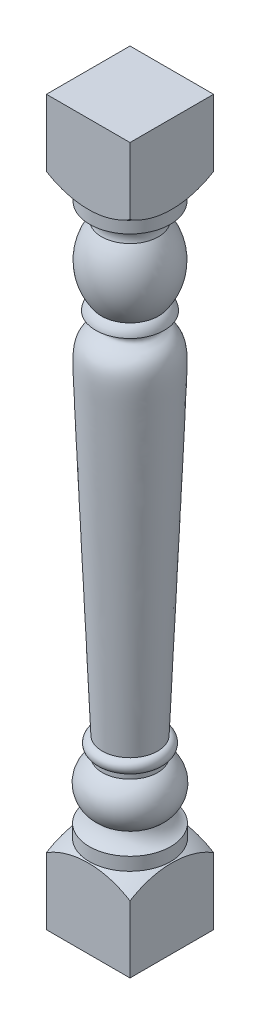
ISO-10303-21;
HEADER;
FILE_DESCRIPTION(('STEP AP214'),'2;1');
FILE_NAME('part.step','',(''),(''),'','','');
FILE_SCHEMA(('AUTOMOTIVE_DESIGN { 1 0 10303 214 1 1 1 1 }'));
ENDSEC;
DATA;
#1=APPLICATION_CONTEXT('core data for automotive mechanical design processes');
#2=APPLICATION_PROTOCOL_DEFINITION('international standard','automotive_design',2000,#1);
#3=PRODUCT_CONTEXT('',#1,'mechanical');
#4=PRODUCT('Part','Part','',(#3));
#5=PRODUCT_RELATED_PRODUCT_CATEGORY('part','',(#4));
#6=PRODUCT_DEFINITION_FORMATION('','',#4);
#7=PRODUCT_DEFINITION_CONTEXT('part definition',#1,'design');
#8=PRODUCT_DEFINITION('design','',#6,#7);
#9=PRODUCT_DEFINITION_SHAPE('','',#8);
#10=(LENGTH_UNIT() NAMED_UNIT(*) SI_UNIT(.MILLI.,.METRE.));
#11=(NAMED_UNIT(*) PLANE_ANGLE_UNIT() SI_UNIT($,.RADIAN.));
#12=(NAMED_UNIT(*) SI_UNIT($,.STERADIAN.) SOLID_ANGLE_UNIT());
#13=UNCERTAINTY_MEASURE_WITH_UNIT(LENGTH_MEASURE(1.E-05),#10,'distance_accuracy_value','');
#14=(GEOMETRIC_REPRESENTATION_CONTEXT(3) GLOBAL_UNCERTAINTY_ASSIGNED_CONTEXT((#13)) GLOBAL_UNIT_ASSIGNED_CONTEXT((#10,
#11,#12)) REPRESENTATION_CONTEXT('',''));
#15=CARTESIAN_POINT('',(0.,0.,0.));
#16=DIRECTION('',(0.,0.,1.));
#17=DIRECTION('',(1.,0.,0.));
#18=AXIS2_PLACEMENT_3D('',#15,#16,#17);
#19=CARTESIAN_POINT('',(71.4375,1101.13709756262,0.));
#20=DIRECTION('',(0.,-1.,0.));
#21=DIRECTION('',(-1.,0.,0.));
#22=AXIS2_PLACEMENT_3D('',#19,#20,#21);
#23=SPHERICAL_SURFACE('',#22,152.4);
#24=CARTESIAN_POINT('',(71.4375,965.2,0.));
#25=DIRECTION('',(0.,-1.,0.));
#26=DIRECTION('',(0.,0.,-1.));
#27=AXIS2_PLACEMENT_3D('',#24,#25,#26);
#28=CIRCLE('',#27,68.8975);
#29=CARTESIAN_POINT('',(71.4375,965.2,-68.8975));
#30=VERTEX_POINT('',#29);
#31=EDGE_CURVE('E224',#30,#30,#28,.T.);
#32=ORIENTED_EDGE('',*,*,#31,.F.);
#33=EDGE_LOOP('',(#32));
#34=FACE_BOUND('',#33,.T.);
#35=CARTESIAN_POINT('',(0.,1101.13709756262,0.));
#36=DIRECTION('',(-1.,0.,0.));
#37=DIRECTION('',(0.,0.,1.));
#38=AXIS2_PLACEMENT_3D('',#35,#36,#37);
#39=CIRCLE('',#38,134.619625589102);
#40=CARTESIAN_POINT('',(0.,987.035707617101,-71.4375));
#41=VERTEX_POINT('',#40);
#42=CARTESIAN_POINT('',(0.,987.035707617101,71.4375));
#43=VERTEX_POINT('',#42);
#44=EDGE_CURVE('E107',#41,#43,#39,.T.);
#45=ORIENTED_EDGE('',*,*,#44,.F.);
#46=CARTESIAN_POINT('',(71.4375,1101.13709756262,-71.4375));
#47=DIRECTION('',(0.,0.,-1.));
#48=DIRECTION('',(-1.,0.,0.));
#49=AXIS2_PLACEMENT_3D('',#46,#47,#48);
#50=CIRCLE('',#49,134.619625589102);
#51=CARTESIAN_POINT('',(142.875,987.035707617101,-71.4375));
#52=VERTEX_POINT('',#51);
#53=EDGE_CURVE('E149',#52,#41,#50,.T.);
#54=ORIENTED_EDGE('',*,*,#53,.F.);
#55=CARTESIAN_POINT('',(142.875,1101.13709756262,0.));
#56=DIRECTION('',(1.,0.,0.));
#57=DIRECTION('',(0.,0.,-1.));
#58=AXIS2_PLACEMENT_3D('',#55,#56,#57);
#59=CIRCLE('',#58,134.619625589102);
#60=CARTESIAN_POINT('',(142.875,987.035707617101,71.4374999999999));
#61=VERTEX_POINT('',#60);
#62=EDGE_CURVE('E147',#61,#52,#59,.T.);
#63=ORIENTED_EDGE('',*,*,#62,.F.);
#64=CARTESIAN_POINT('',(71.4375000000001,1101.13709756262,71.4374999999999));
#65=DIRECTION('',(0.,0.,1.));
#66=DIRECTION('',(1.,0.,0.));
#67=AXIS2_PLACEMENT_3D('',#64,#65,#66);
#68=CIRCLE('',#67,134.619625589102);
#69=EDGE_CURVE('E138',#43,#61,#68,.T.);
#70=ORIENTED_EDGE('',*,*,#69,.F.);
#71=EDGE_LOOP('',(#45,#54,#63,#70));
#72=FACE_BOUND('',#71,.T.);
#73=ADVANCED_FACE('F33',(#34,#72),#23,.T.);
#74=CARTESIAN_POINT('',(71.4375,-135.613389618245,0.));
#75=DIRECTION('',(0.,-1.,0.));
#76=DIRECTION('',(-1.,0.,0.));
#77=AXIS2_PLACEMENT_3D('',#74,#75,#76);
#78=SPHERICAL_SURFACE('',#77,152.4);
#79=CARTESIAN_POINT('',(71.4375,0.,0.));
#80=DIRECTION('',(0.,-1.,0.));
#81=DIRECTION('',(0.,0.,-1.));
#82=AXIS2_PLACEMENT_3D('',#79,#80,#81);
#83=CIRCLE('',#82,69.5325);
#84=CARTESIAN_POINT('',(71.4375,0.,-69.5325));
#85=VERTEX_POINT('',#84);
#86=EDGE_CURVE('E152',#85,#85,#83,.T.);
#87=ORIENTED_EDGE('',*,*,#86,.T.);
#88=EDGE_LOOP('',(#87));
#89=FACE_BOUND('',#88,.T.);
#90=CARTESIAN_POINT('',(0.,-135.613389618245,0.));
#91=DIRECTION('',(-1.,0.,0.));
#92=DIRECTION('',(0.,0.,1.));
#93=AXIS2_PLACEMENT_3D('',#90,#91,#92);
#94=CIRCLE('',#93,134.619625589102);
#95=CARTESIAN_POINT('',(0.,-21.5119996727236,71.4375));
#96=VERTEX_POINT('',#95);
#97=CARTESIAN_POINT('',(0.,-21.5119996727236,-71.4375));
#98=VERTEX_POINT('',#97);
#99=EDGE_CURVE('E12',#96,#98,#94,.T.);
#100=ORIENTED_EDGE('',*,*,#99,.F.);
#101=CARTESIAN_POINT('',(71.4375000000001,-135.613389618245,71.4374999999999));
#102=DIRECTION('',(0.,0.,1.));
#103=DIRECTION('',(1.,0.,0.));
#104=AXIS2_PLACEMENT_3D('',#101,#102,#103);
#105=CIRCLE('',#104,134.619625589102);
#106=CARTESIAN_POINT('',(142.875,-21.5119996727235,71.4374999999999));
#107=VERTEX_POINT('',#106);
#108=EDGE_CURVE('E217',#107,#96,#105,.T.);
#109=ORIENTED_EDGE('',*,*,#108,.F.);
#110=CARTESIAN_POINT('',(142.875,-135.613389618245,0.));
#111=DIRECTION('',(1.,0.,0.));
#112=DIRECTION('',(0.,0.,-1.));
#113=AXIS2_PLACEMENT_3D('',#110,#111,#112);
#114=CIRCLE('',#113,134.619625589102);
#115=CARTESIAN_POINT('',(142.875,-21.5119996727235,-71.4375));
#116=VERTEX_POINT('',#115);
#117=EDGE_CURVE('E223',#116,#107,#114,.T.);
#118=ORIENTED_EDGE('',*,*,#117,.F.);
#119=CARTESIAN_POINT('',(71.4375,-135.613389618245,-71.4375));
#120=DIRECTION('',(0.,0.,-1.));
#121=DIRECTION('',(-1.,0.,0.));
#122=AXIS2_PLACEMENT_3D('',#119,#120,#121);
#123=CIRCLE('',#122,134.619625589102);
#124=EDGE_CURVE('E41',#98,#116,#123,.T.);
#125=ORIENTED_EDGE('',*,*,#124,.F.);
#126=EDGE_LOOP('',(#100,#109,#118,#125));
#127=FACE_BOUND('',#126,.T.);
#128=ADVANCED_FACE('F184',(#89,#127),#78,.T.);
#129=CARTESIAN_POINT('',(71.4375,-135.613389618245,0.));
#130=DIRECTION('',(0.,-1.,0.));
#131=DIRECTION('',(0.,0.,-1.));
#132=AXIS2_PLACEMENT_3D('',#129,#130,#131);
#133=CYLINDRICAL_SURFACE('',#132,68.8975);
#134=CARTESIAN_POINT('',(71.4375,942.975,0.));
#135=DIRECTION('',(0.,-1.,0.));
#136=DIRECTION('',(0.,0.,-1.));
#137=AXIS2_PLACEMENT_3D('',#134,#135,#136);
#138=CIRCLE('',#137,68.8975);
#139=CARTESIAN_POINT('',(71.4375,942.975,-68.8975));
#140=VERTEX_POINT('',#139);
#141=EDGE_CURVE('E233',#140,#140,#138,.T.);
#142=ORIENTED_EDGE('',*,*,#141,.F.);
#143=EDGE_LOOP('',(#142));
#144=FACE_BOUND('',#143,.T.);
#145=ORIENTED_EDGE('',*,*,#31,.T.);
#146=EDGE_LOOP('',(#145));
#147=FACE_BOUND('',#146,.T.);
#148=ADVANCED_FACE('F180',(#144,#147),#133,.T.);
#149=CARTESIAN_POINT('',(71.4375,921.049803557332,0.));
#150=DIRECTION('',(0.,-1.,0.));
#151=DIRECTION('',(0.,0.,-1.));
#152=AXIS2_PLACEMENT_3D('',#149,#150,#151);
#153=TOROIDAL_SURFACE('',#152,69.4780106225019,21.9328801490461);
#154=CARTESIAN_POINT('',(71.4375,914.4,0.));
#155=DIRECTION('',(0.,-1.,0.));
#156=DIRECTION('',(0.,0.,-1.));
#157=AXIS2_PLACEMENT_3D('',#154,#155,#156);
#158=CIRCLE('',#157,48.5775);
#159=CARTESIAN_POINT('',(71.4375,914.4,-48.5775));
#160=VERTEX_POINT('',#159);
#161=EDGE_CURVE('E236',#160,#160,#158,.T.);
#162=ORIENTED_EDGE('',*,*,#161,.F.);
#163=EDGE_LOOP('',(#162));
#164=FACE_BOUND('',#163,.T.);
#165=ORIENTED_EDGE('',*,*,#141,.T.);
#166=EDGE_LOOP('',(#165));
#167=FACE_BOUND('',#166,.T.);
#168=ADVANCED_FACE('F176',(#164,#167),#153,.F.);
#169=CARTESIAN_POINT('',(71.4375,855.6625,0.));
#170=DIRECTION('',(0.,-1.,0.));
#171=DIRECTION('',(0.,0.,-1.));
#172=AXIS2_PLACEMENT_3D('',#169,#170,#171);
#173=DEGENERATE_TOROIDAL_SURFACE('',#172,26.15654296875,95.05404296875,.F.);
#174=CARTESIAN_POINT('',(71.4375,796.925,0.));
#175=DIRECTION('',(0.,-1.,0.));
#176=DIRECTION('',(0.,0.,-1.));
#177=AXIS2_PLACEMENT_3D('',#174,#175,#176);
#178=CIRCLE('',#177,48.5775);
#179=CARTESIAN_POINT('',(71.4375,796.925,-48.5775));
#180=VERTEX_POINT('',#179);
#181=EDGE_CURVE('E239',#180,#180,#178,.T.);
#182=ORIENTED_EDGE('',*,*,#181,.F.);
#183=EDGE_LOOP('',(#182));
#184=FACE_BOUND('',#183,.T.);
#185=ORIENTED_EDGE('',*,*,#161,.T.);
#186=EDGE_LOOP('',(#185));
#187=FACE_BOUND('',#186,.T.);
#188=ADVANCED_FACE('F172',(#184,#187),#173,.F.);
#189=CARTESIAN_POINT('',(71.4375,777.398971107614,0.));
#190=DIRECTION('',(0.,-1.,0.));
#191=DIRECTION('',(0.,0.,-1.));
#192=AXIS2_PLACEMENT_3D('',#189,#190,#191);
#193=TOROIDAL_SURFACE('',#192,35.5504236056465,23.4727613137148);
#194=CARTESIAN_POINT('',(71.4375,781.05,0.));
#195=DIRECTION('',(0.,-1.,0.));
#196=DIRECTION('',(0.,0.,-1.));
#197=AXIS2_PLACEMENT_3D('',#194,#195,#196);
#198=CIRCLE('',#197,58.7375);
#199=CARTESIAN_POINT('',(71.4375,781.05,-58.7375));
#200=VERTEX_POINT('',#199);
#201=EDGE_CURVE('E242',#200,#200,#198,.T.);
#202=ORIENTED_EDGE('',*,*,#201,.F.);
#203=EDGE_LOOP('',(#202));
#204=FACE_BOUND('',#203,.T.);
#205=ORIENTED_EDGE('',*,*,#181,.T.);
#206=EDGE_LOOP('',(#205));
#207=FACE_BOUND('',#206,.T.);
#208=ADVANCED_FACE('F167',(#204,#207),#193,.T.);
#209=CARTESIAN_POINT('',(12.7,781.05,0.));
#210=CARTESIAN_POINT('',(28.5432760874866,778.212494124959,0.));
#211=CARTESIAN_POINT('',(43.2562729493515,750.690215212591,0.));
#212=CARTESIAN_POINT('',(-0.0352258001827218,758.012837993779,0.));
#213=CARTESIAN_POINT('',(6.58631930102401,584.753689168039,0.));
#214=CARTESIAN_POINT('',(4.68311177432794,626.517341683283,0.));
#215=CARTESIAN_POINT('',(24.13,152.399999999999,0.));
#216=B_SPLINE_CURVE_WITH_KNOTS('',3,(#209,#210,#211,#212,#213,#214,#215),.UNSPECIFIED.,.F.,.F.,
(4,1,1,1,4),(0.,0.117084259686259,0.342939455018495,0.431231029049869,1.),.UNSPECIFIED.);
#217=CARTESIAN_POINT('',(71.4375,-135.613389618245,0.));
#218=DIRECTION('',(0.,-1.,0.));
#219=AXIS1_PLACEMENT('',#217,#218);
#220=SURFACE_OF_REVOLUTION('',#216,#219);
#221=CARTESIAN_POINT('',(71.4375,152.399999999999,0.));
#222=DIRECTION('',(0.,-1.,0.));
#223=DIRECTION('',(0.,0.,-1.));
#224=AXIS2_PLACEMENT_3D('',#221,#222,#223);
#225=CIRCLE('',#224,47.3075);
#226=CARTESIAN_POINT('',(71.4375,152.399999999999,-47.3075));
#227=VERTEX_POINT('',#226);
#228=EDGE_CURVE('E245',#227,#227,#225,.T.);
#229=ORIENTED_EDGE('',*,*,#228,.F.);
#230=EDGE_LOOP('',(#229));
#231=FACE_BOUND('',#230,.T.);
#232=ORIENTED_EDGE('',*,*,#201,.T.);
#233=EDGE_LOOP('',(#232));
#234=FACE_BOUND('',#233,.T.);
#235=ADVANCED_FACE('F162',(#231,#234),#220,.T.);
#236=CARTESIAN_POINT('',(71.4375,141.2875,0.));
#237=DIRECTION('',(0.,-1.,0.));
#238=DIRECTION('',(0.,0.,-1.));
#239=AXIS2_PLACEMENT_3D('',#236,#237,#238);
#240=TOROIDAL_SURFACE('',#239,46.3103515625,11.1571484375);
#241=CARTESIAN_POINT('',(71.4375,130.175,0.));
#242=DIRECTION('',(0.,-1.,0.));
#243=DIRECTION('',(0.,0.,-1.));
#244=AXIS2_PLACEMENT_3D('',#241,#242,#243);
#245=CIRCLE('',#244,47.3075);
#246=CARTESIAN_POINT('',(71.4375,130.175,-47.3075));
#247=VERTEX_POINT('',#246);
#248=EDGE_CURVE('E248',#247,#247,#245,.T.);
#249=ORIENTED_EDGE('',*,*,#248,.F.);
#250=EDGE_LOOP('',(#249));
#251=FACE_BOUND('',#250,.T.);
#252=ORIENTED_EDGE('',*,*,#228,.T.);
#253=EDGE_LOOP('',(#252));
#254=FACE_BOUND('',#253,.T.);
#255=ADVANCED_FACE('F166',(#251,#254),#240,.T.);
#256=CARTESIAN_POINT('',(71.4375,-135.613389618245,0.));
#257=DIRECTION('',(0.,-1.,0.));
#258=DIRECTION('',(0.,0.,-1.));
#259=AXIS2_PLACEMENT_3D('',#256,#257,#258);
#260=CYLINDRICAL_SURFACE('',#259,47.3075);
#261=CARTESIAN_POINT('',(71.4375,120.65,0.));
#262=DIRECTION('',(0.,-1.,0.));
#263=DIRECTION('',(0.,0.,-1.));
#264=AXIS2_PLACEMENT_3D('',#261,#262,#263);
#265=CIRCLE('',#264,47.3075);
#266=CARTESIAN_POINT('',(71.4375,120.65,-47.3075));
#267=VERTEX_POINT('',#266);
#268=EDGE_CURVE('E251',#267,#267,#265,.T.);
#269=ORIENTED_EDGE('',*,*,#268,.F.);
#270=EDGE_LOOP('',(#269));
#271=FACE_BOUND('',#270,.T.);
#272=ORIENTED_EDGE('',*,*,#248,.T.);
#273=EDGE_LOOP('',(#272));
#274=FACE_BOUND('',#273,.T.);
#275=ADVANCED_FACE('F273',(#271,#274),#260,.T.);
#276=CARTESIAN_POINT('',(71.4375,82.1853057943023,0.));
#277=DIRECTION('',(0.,-1.,0.));
#278=DIRECTION('',(0.,0.,-1.));
#279=AXIS2_PLACEMENT_3D('',#276,#277,#278);
#280=DEGENERATE_TOROIDAL_SURFACE('',#279,26.0608476581362,43.942609572872,.T.);
#281=CARTESIAN_POINT('',(71.4375,44.45,0.));
#282=DIRECTION('',(0.,-1.,0.));
#283=DIRECTION('',(0.,0.,-1.));
#284=AXIS2_PLACEMENT_3D('',#281,#282,#283);
#285=CIRCLE('',#284,48.5775);
#286=CARTESIAN_POINT('',(71.4375,44.45,-48.5775));
#287=VERTEX_POINT('',#286);
#288=EDGE_CURVE('E254',#287,#287,#285,.T.);
#289=ORIENTED_EDGE('',*,*,#288,.F.);
#290=EDGE_LOOP('',(#289));
#291=FACE_BOUND('',#290,.T.);
#292=ORIENTED_EDGE('',*,*,#268,.T.);
#293=EDGE_LOOP('',(#292));
#294=FACE_BOUND('',#293,.T.);
#295=ADVANCED_FACE('F270',(#291,#294),#280,.T.);
#296=CARTESIAN_POINT('',(71.4375,56.6976099284752,0.));
#297=DIRECTION('',(0.,-1.,0.));
#298=DIRECTION('',(0.,0.,-1.));
#299=AXIS2_PLACEMENT_3D('',#296,#297,#298);
#300=TOROIDAL_SURFACE('',#299,83.8308741665646,37.3202939308882);
#301=CARTESIAN_POINT('',(71.4375,22.225,0.));
#302=DIRECTION('',(0.,-1.,0.));
#303=DIRECTION('',(0.,0.,-1.));
#304=AXIS2_PLACEMENT_3D('',#301,#302,#303);
#305=CIRCLE('',#304,69.5325);
#306=CARTESIAN_POINT('',(71.4375,22.225,-69.5325));
#307=VERTEX_POINT('',#306);
#308=EDGE_CURVE('E256',#307,#307,#305,.T.);
#309=ORIENTED_EDGE('',*,*,#308,.F.);
#310=EDGE_LOOP('',(#309));
#311=FACE_BOUND('',#310,.T.);
#312=ORIENTED_EDGE('',*,*,#288,.T.);
#313=EDGE_LOOP('',(#312));
#314=FACE_BOUND('',#313,.T.);
#315=ADVANCED_FACE('F213',(#311,#314),#300,.F.);
#316=CARTESIAN_POINT('',(71.4375,-135.613389618245,0.));
#317=DIRECTION('',(0.,-1.,0.));
#318=DIRECTION('',(0.,0.,-1.));
#319=AXIS2_PLACEMENT_3D('',#316,#317,#318);
#320=CYLINDRICAL_SURFACE('',#319,69.5325);
#321=ORIENTED_EDGE('',*,*,#86,.F.);
#322=EDGE_LOOP('',(#321));
#323=FACE_BOUND('',#322,.T.);
#324=ORIENTED_EDGE('',*,*,#308,.T.);
#325=EDGE_LOOP('',(#324));
#326=FACE_BOUND('',#325,.T.);
#327=ADVANCED_FACE('F205',(#323,#326),#320,.T.);
#328=CARTESIAN_POINT('',(0.,-135.613389618245,71.4375));
#329=DIRECTION('',(0.,0.,1.));
#330=DIRECTION('',(1.,0.,0.));
#331=AXIS2_PLACEMENT_3D('',#328,#329,#330);
#332=PLANE('',#331);
#333=ORIENTED_EDGE('',*,*,#108,.T.);
#334=DIRECTION('',(0.,1.,0.));
#335=VECTOR('',#334,1.);
#336=CARTESIAN_POINT('',(0.,-135.613389618245,71.4375));
#337=LINE('',#336,#335);
#338=CARTESIAN_POINT('',(0.,-135.613389618245,71.4375));
#339=VERTEX_POINT('',#338);
#340=EDGE_CURVE('E110',#339,#96,#337,.T.);
#341=ORIENTED_EDGE('',*,*,#340,.F.);
#342=DIRECTION('',(1.,0.,0.));
#343=VECTOR('',#342,1.);
#344=CARTESIAN_POINT('',(0.,-135.613389618245,71.4375));
#345=LINE('',#344,#343);
#346=CARTESIAN_POINT('',(142.875,-135.613389618245,71.4374999999999));
#347=VERTEX_POINT('',#346);
#348=EDGE_CURVE('E127',#339,#347,#345,.T.);
#349=ORIENTED_EDGE('',*,*,#348,.T.);
#350=DIRECTION('',(0.,1.,0.));
#351=VECTOR('',#350,1.);
#352=CARTESIAN_POINT('',(142.875,-135.613389618245,71.4374999999999));
#353=LINE('',#352,#351);
#354=EDGE_CURVE('E144',#347,#107,#353,.T.);
#355=ORIENTED_EDGE('',*,*,#354,.T.);
#356=EDGE_LOOP('',(#333,#341,#349,#355));
#357=FACE_BOUND('',#356,.T.);
#358=ADVANCED_FACE('F196',(#357),#332,.T.);
#359=CARTESIAN_POINT('',(142.875,-135.613389618245,-71.4375));
#360=DIRECTION('',(1.,0.,0.));
#361=DIRECTION('',(0.,0.,-1.));
#362=AXIS2_PLACEMENT_3D('',#359,#360,#361);
#363=PLANE('',#362);
#364=ORIENTED_EDGE('',*,*,#117,.T.);
#365=ORIENTED_EDGE('',*,*,#354,.F.);
#366=DIRECTION('',(0.,0.,-1.));
#367=VECTOR('',#366,1.);
#368=CARTESIAN_POINT('',(142.875,-135.613389618245,-71.4375));
#369=LINE('',#368,#367);
#370=CARTESIAN_POINT('',(142.875,-135.613389618245,-71.4375));
#371=VERTEX_POINT('',#370);
#372=EDGE_CURVE('E130',#347,#371,#369,.T.);
#373=ORIENTED_EDGE('',*,*,#372,.T.);
#374=DIRECTION('',(0.,1.,0.));
#375=VECTOR('',#374,1.);
#376=CARTESIAN_POINT('',(142.875,-135.613389618245,-71.4375));
#377=LINE('',#376,#375);
#378=EDGE_CURVE('E140',#371,#116,#377,.T.);
#379=ORIENTED_EDGE('',*,*,#378,.T.);
#380=EDGE_LOOP('',(#364,#365,#373,#379));
#381=FACE_BOUND('',#380,.T.);
#382=ADVANCED_FACE('F202',(#381),#363,.T.);
#383=CARTESIAN_POINT('',(0.,-135.613389618245,-71.4375));
#384=DIRECTION('',(0.,0.,-1.));
#385=DIRECTION('',(-1.,0.,0.));
#386=AXIS2_PLACEMENT_3D('',#383,#384,#385);
#387=PLANE('',#386);
#388=ORIENTED_EDGE('',*,*,#124,.T.);
#389=ORIENTED_EDGE('',*,*,#378,.F.);
#390=DIRECTION('',(-1.,0.,0.));
#391=VECTOR('',#390,1.);
#392=CARTESIAN_POINT('',(0.,-135.613389618245,-71.4375));
#393=LINE('',#392,#391);
#394=CARTESIAN_POINT('',(0.,-135.613389618245,-71.4375));
#395=VERTEX_POINT('',#394);
#396=EDGE_CURVE('E111',#371,#395,#393,.T.);
#397=ORIENTED_EDGE('',*,*,#396,.T.);
#398=DIRECTION('',(0.,1.,0.));
#399=VECTOR('',#398,1.);
#400=CARTESIAN_POINT('',(0.,-135.613389618245,-71.4375));
#401=LINE('',#400,#399);
#402=EDGE_CURVE('E135',#395,#98,#401,.T.);
#403=ORIENTED_EDGE('',*,*,#402,.T.);
#404=EDGE_LOOP('',(#388,#389,#397,#403));
#405=FACE_BOUND('',#404,.T.);
#406=ADVANCED_FACE('F211',(#405),#387,.T.);
#407=CARTESIAN_POINT('',(0.,-135.613389618245,-71.4375));
#408=DIRECTION('',(-1.,0.,0.));
#409=DIRECTION('',(0.,0.,1.));
#410=AXIS2_PLACEMENT_3D('',#407,#408,#409);
#411=PLANE('',#410);
#412=ORIENTED_EDGE('',*,*,#99,.T.);
#413=ORIENTED_EDGE('',*,*,#402,.F.);
#414=DIRECTION('',(0.,0.,1.));
#415=VECTOR('',#414,1.);
#416=CARTESIAN_POINT('',(0.,-135.613389618245,-71.4375));
#417=LINE('',#416,#415);
#418=EDGE_CURVE('E48',#395,#339,#417,.T.);
#419=ORIENTED_EDGE('',*,*,#418,.T.);
#420=ORIENTED_EDGE('',*,*,#340,.T.);
#421=EDGE_LOOP('',(#412,#413,#419,#420));
#422=FACE_BOUND('',#421,.T.);
#423=ADVANCED_FACE('F226',(#422),#411,.T.);
#424=ORIENTED_EDGE('',*,*,#44,.T.);
#425=CARTESIAN_POINT('',(0.,1101.13709756262,71.4375));
#426=VERTEX_POINT('',#425);
#427=EDGE_CURVE('E99',#43,#426,#337,.T.);
#428=ORIENTED_EDGE('',*,*,#427,.T.);
#429=DIRECTION('',(0.,0.,1.));
#430=VECTOR('',#429,1.);
#431=CARTESIAN_POINT('',(0.,1101.13709756262,-71.4375));
#432=LINE('',#431,#430);
#433=CARTESIAN_POINT('',(0.,1101.13709756262,-71.4375));
#434=VERTEX_POINT('',#433);
#435=EDGE_CURVE('E104',#434,#426,#432,.T.);
#436=ORIENTED_EDGE('',*,*,#435,.F.);
#437=EDGE_CURVE('E139',#41,#434,#401,.T.);
#438=ORIENTED_EDGE('',*,*,#437,.F.);
#439=EDGE_LOOP('',(#424,#428,#436,#438));
#440=FACE_BOUND('',#439,.T.);
#441=ADVANCED_FACE('F101',(#440),#411,.T.);
#442=ORIENTED_EDGE('',*,*,#53,.T.);
#443=ORIENTED_EDGE('',*,*,#437,.T.);
#444=DIRECTION('',(-1.,0.,0.));
#445=VECTOR('',#444,1.);
#446=CARTESIAN_POINT('',(0.,1101.13709756262,-71.4375));
#447=LINE('',#446,#445);
#448=CARTESIAN_POINT('',(142.875,1101.13709756262,-71.4375));
#449=VERTEX_POINT('',#448);
#450=EDGE_CURVE('E121',#449,#434,#447,.T.);
#451=ORIENTED_EDGE('',*,*,#450,.F.);
#452=EDGE_CURVE('E143',#52,#449,#377,.T.);
#453=ORIENTED_EDGE('',*,*,#452,.F.);
#454=EDGE_LOOP('',(#442,#443,#451,#453));
#455=FACE_BOUND('',#454,.T.);
#456=ADVANCED_FACE('F200',(#455),#387,.T.);
#457=ORIENTED_EDGE('',*,*,#62,.T.);
#458=ORIENTED_EDGE('',*,*,#452,.T.);
#459=DIRECTION('',(0.,0.,-1.));
#460=VECTOR('',#459,1.);
#461=CARTESIAN_POINT('',(142.875,1101.13709756262,-71.4375));
#462=LINE('',#461,#460);
#463=CARTESIAN_POINT('',(142.875,1101.13709756262,71.4374999999999));
#464=VERTEX_POINT('',#463);
#465=EDGE_CURVE('E56',#464,#449,#462,.T.);
#466=ORIENTED_EDGE('',*,*,#465,.F.);
#467=EDGE_CURVE('E116',#61,#464,#353,.T.);
#468=ORIENTED_EDGE('',*,*,#467,.F.);
#469=EDGE_LOOP('',(#457,#458,#466,#468));
#470=FACE_BOUND('',#469,.T.);
#471=ADVANCED_FACE('F194',(#470),#363,.T.);
#472=ORIENTED_EDGE('',*,*,#69,.T.);
#473=ORIENTED_EDGE('',*,*,#467,.T.);
#474=DIRECTION('',(1.,0.,0.));
#475=VECTOR('',#474,1.);
#476=CARTESIAN_POINT('',(0.,1101.13709756262,71.4375));
#477=LINE('',#476,#475);
#478=EDGE_CURVE('E114',#426,#464,#477,.T.);
#479=ORIENTED_EDGE('',*,*,#478,.F.);
#480=ORIENTED_EDGE('',*,*,#427,.F.);
#481=EDGE_LOOP('',(#472,#473,#479,#480));
#482=FACE_BOUND('',#481,.T.);
#483=ADVANCED_FACE('F115',(#482),#332,.T.);
#484=CARTESIAN_POINT('',(-80.9625,1101.13709756262,0.));
#485=DIRECTION('',(0.,-1.,0.));
#486=DIRECTION('',(0.,0.,-1.));
#487=AXIS2_PLACEMENT_3D('',#484,#485,#486);
#488=PLANE('',#487);
#489=ORIENTED_EDGE('',*,*,#435,.T.);
#490=ORIENTED_EDGE('',*,*,#478,.T.);
#491=ORIENTED_EDGE('',*,*,#465,.T.);
#492=ORIENTED_EDGE('',*,*,#450,.T.);
#493=EDGE_LOOP('',(#489,#490,#491,#492));
#494=FACE_BOUND('',#493,.T.);
#495=ADVANCED_FACE('F119',(#494),#488,.F.);
#496=CARTESIAN_POINT('',(0.,-135.613389618245,0.));
#497=DIRECTION('',(0.,1.,0.));
#498=DIRECTION('',(0.,0.,1.));
#499=AXIS2_PLACEMENT_3D('',#496,#497,#498);
#500=PLANE('',#499);
#501=ORIENTED_EDGE('',*,*,#418,.F.);
#502=ORIENTED_EDGE('',*,*,#396,.F.);
#503=ORIENTED_EDGE('',*,*,#372,.F.);
#504=ORIENTED_EDGE('',*,*,#348,.F.);
#505=EDGE_LOOP('',(#501,#502,#503,#504));
#506=FACE_BOUND('',#505,.T.);
#507=ADVANCED_FACE('F35',(#506),#500,.F.);
#508=CLOSED_SHELL('',(#73,#128,#148,#168,#188,#208,#235,#255,#275,#295,#315,#327,#358,#382,#406,
#423,#441,#456,#471,#483,#495,#507));
#509=MANIFOLD_SOLID_BREP('B2',#508);
#510=ADVANCED_BREP_SHAPE_REPRESENTATION('',(#18,#509),#14);
#511=SHAPE_DEFINITION_REPRESENTATION(#9,#510);
ENDSEC;
END-ISO-10303-21;
